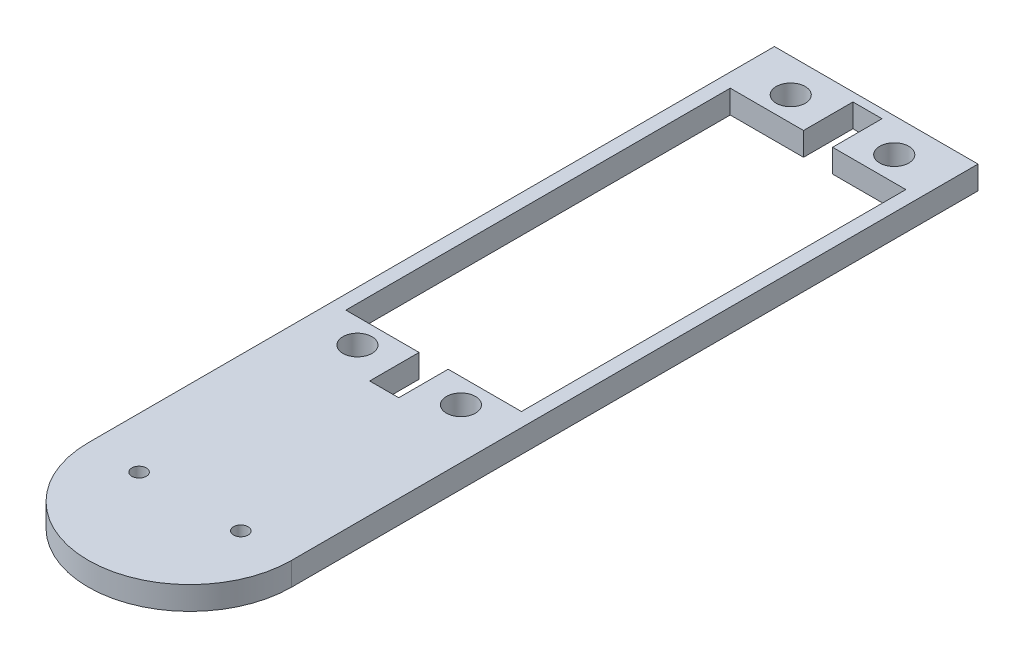
ISO-10303-21;
HEADER;
FILE_DESCRIPTION(('STEP AP214'),'2;1');
FILE_NAME('part.step','',(''),(''),'','','');
FILE_SCHEMA(('AUTOMOTIVE_DESIGN { 1 0 10303 214 1 1 1 1 }'));
ENDSEC;
DATA;
#1=APPLICATION_CONTEXT('core data for automotive mechanical design processes');
#2=APPLICATION_PROTOCOL_DEFINITION('international standard','automotive_design',2000,#1);
#3=PRODUCT_CONTEXT('',#1,'mechanical');
#4=PRODUCT('Part','Part','',(#3));
#5=PRODUCT_RELATED_PRODUCT_CATEGORY('part','',(#4));
#6=PRODUCT_DEFINITION_FORMATION('','',#4);
#7=PRODUCT_DEFINITION_CONTEXT('part definition',#1,'design');
#8=PRODUCT_DEFINITION('design','',#6,#7);
#9=PRODUCT_DEFINITION_SHAPE('','',#8);
#10=(LENGTH_UNIT() NAMED_UNIT(*) SI_UNIT(.MILLI.,.METRE.));
#11=(NAMED_UNIT(*) PLANE_ANGLE_UNIT() SI_UNIT($,.RADIAN.));
#12=(NAMED_UNIT(*) SI_UNIT($,.STERADIAN.) SOLID_ANGLE_UNIT());
#13=UNCERTAINTY_MEASURE_WITH_UNIT(LENGTH_MEASURE(1.E-05),#10,'distance_accuracy_value','');
#14=(GEOMETRIC_REPRESENTATION_CONTEXT(3) GLOBAL_UNCERTAINTY_ASSIGNED_CONTEXT((#13)) GLOBAL_UNIT_ASSIGNED_CONTEXT((#10,
#11,#12)) REPRESENTATION_CONTEXT('',''));
#15=CARTESIAN_POINT('',(0.,0.,0.));
#16=DIRECTION('',(0.,0.,1.));
#17=DIRECTION('',(1.,0.,0.));
#18=AXIS2_PLACEMENT_3D('',#15,#16,#17);
#19=CARTESIAN_POINT('',(-15.1,0.,-108.));
#20=DIRECTION('',(0.,0.,-1.));
#21=DIRECTION('',(-1.,0.,0.));
#22=AXIS2_PLACEMENT_3D('',#19,#20,#21);
#23=PLANE('',#22);
#24=DIRECTION('',(-1.,0.,0.));
#25=VECTOR('',#24,1.);
#26=CARTESIAN_POINT('',(-15.1,4.,-108.));
#27=LINE('',#26,#25);
#28=CARTESIAN_POINT('',(15.1,4.,-108.));
#29=VERTEX_POINT('',#28);
#30=CARTESIAN_POINT('',(2.49999999999999,4.,-108.));
#31=VERTEX_POINT('',#30);
#32=EDGE_CURVE('E249',#29,#31,#27,.T.);
#33=ORIENTED_EDGE('',*,*,#32,.T.);
#34=DIRECTION('',(0.,1.,0.));
#35=VECTOR('',#34,1.);
#36=CARTESIAN_POINT('',(2.49999999999999,0.,-108.));
#37=LINE('',#36,#35);
#38=CARTESIAN_POINT('',(2.49999999999999,0.,-108.));
#39=VERTEX_POINT('',#38);
#40=EDGE_CURVE('E180',#39,#31,#37,.T.);
#41=ORIENTED_EDGE('',*,*,#40,.F.);
#42=DIRECTION('',(-1.,0.,0.));
#43=VECTOR('',#42,1.);
#44=CARTESIAN_POINT('',(-15.1,0.,-108.));
#45=LINE('',#44,#43);
#46=CARTESIAN_POINT('',(15.1,0.,-108.));
#47=VERTEX_POINT('',#46);
#48=EDGE_CURVE('E172',#47,#39,#45,.T.);
#49=ORIENTED_EDGE('',*,*,#48,.F.);
#50=DIRECTION('',(0.,1.,0.));
#51=VECTOR('',#50,1.);
#52=CARTESIAN_POINT('',(15.1,0.,-108.));
#53=LINE('',#52,#51);
#54=EDGE_CURVE('E246',#47,#29,#53,.T.);
#55=ORIENTED_EDGE('',*,*,#54,.T.);
#56=EDGE_LOOP('',(#33,#41,#49,#55));
#57=FACE_BOUND('',#56,.T.);
#58=ADVANCED_FACE('F34',(#57),#23,.F.);
#59=CARTESIAN_POINT('',(-15.1,0.,-41.9));
#60=DIRECTION('',(0.,0.,1.));
#61=DIRECTION('',(1.,0.,0.));
#62=AXIS2_PLACEMENT_3D('',#59,#60,#61);
#63=PLANE('',#62);
#64=DIRECTION('',(1.,0.,0.));
#65=VECTOR('',#64,1.);
#66=CARTESIAN_POINT('',(-15.1,0.,-41.9));
#67=LINE('',#66,#65);
#68=CARTESIAN_POINT('',(2.49999999999999,0.,-41.9));
#69=VERTEX_POINT('',#68);
#70=CARTESIAN_POINT('',(15.1,0.,-41.9));
#71=VERTEX_POINT('',#70);
#72=EDGE_CURVE('E242',#69,#71,#67,.T.);
#73=ORIENTED_EDGE('',*,*,#72,.F.);
#74=DIRECTION('',(0.,1.,0.));
#75=VECTOR('',#74,1.);
#76=CARTESIAN_POINT('',(2.49999999999999,0.,-41.9));
#77=LINE('',#76,#75);
#78=CARTESIAN_POINT('',(2.49999999999999,4.,-41.9));
#79=VERTEX_POINT('',#78);
#80=EDGE_CURVE('E201',#69,#79,#77,.T.);
#81=ORIENTED_EDGE('',*,*,#80,.T.);
#82=DIRECTION('',(1.,0.,0.));
#83=VECTOR('',#82,1.);
#84=CARTESIAN_POINT('',(-15.1,4.,-41.9));
#85=LINE('',#84,#83);
#86=CARTESIAN_POINT('',(15.1,4.,-41.9));
#87=VERTEX_POINT('',#86);
#88=EDGE_CURVE('E255',#79,#87,#85,.T.);
#89=ORIENTED_EDGE('',*,*,#88,.T.);
#90=DIRECTION('',(0.,1.,0.));
#91=VECTOR('',#90,1.);
#92=CARTESIAN_POINT('',(15.1,0.,-41.9));
#93=LINE('',#92,#91);
#94=EDGE_CURVE('E258',#71,#87,#93,.T.);
#95=ORIENTED_EDGE('',*,*,#94,.F.);
#96=EDGE_LOOP('',(#73,#81,#89,#95));
#97=FACE_BOUND('',#96,.T.);
#98=ADVANCED_FACE('F330',(#97),#63,.F.);
#99=CARTESIAN_POINT('',(0.,4.,0.));
#100=DIRECTION('',(0.,-1.,0.));
#101=DIRECTION('',(0.,0.,-1.));
#102=AXIS2_PLACEMENT_3D('',#99,#100,#101);
#103=CYLINDRICAL_SURFACE('',#102,17.5);
#104=CARTESIAN_POINT('',(0.,0.,0.));
#105=DIRECTION('',(0.,1.,0.));
#106=DIRECTION('',(0.,0.,1.));
#107=AXIS2_PLACEMENT_3D('',#104,#105,#106);
#108=CIRCLE('',#107,17.5);
#109=CARTESIAN_POINT('',(-17.5,0.,0.));
#110=VERTEX_POINT('',#109);
#111=CARTESIAN_POINT('',(17.5,0.,0.));
#112=VERTEX_POINT('',#111);
#113=EDGE_CURVE('E278',#110,#112,#108,.T.);
#114=ORIENTED_EDGE('',*,*,#113,.T.);
#115=DIRECTION('',(0.,-1.,0.));
#116=VECTOR('',#115,1.);
#117=CARTESIAN_POINT('',(17.5,4.,0.));
#118=LINE('',#117,#116);
#119=CARTESIAN_POINT('',(17.5,4.,0.));
#120=VERTEX_POINT('',#119);
#121=EDGE_CURVE('E11',#120,#112,#118,.T.);
#122=ORIENTED_EDGE('',*,*,#121,.F.);
#123=CARTESIAN_POINT('',(0.,4.,0.));
#124=DIRECTION('',(0.,1.,0.));
#125=DIRECTION('',(0.,0.,1.));
#126=AXIS2_PLACEMENT_3D('',#123,#124,#125);
#127=CIRCLE('',#126,17.5);
#128=CARTESIAN_POINT('',(-17.5,4.,0.));
#129=VERTEX_POINT('',#128);
#130=EDGE_CURVE('E281',#129,#120,#127,.T.);
#131=ORIENTED_EDGE('',*,*,#130,.F.);
#132=DIRECTION('',(0.,-1.,0.));
#133=VECTOR('',#132,1.);
#134=CARTESIAN_POINT('',(-17.5,4.,0.));
#135=LINE('',#134,#133);
#136=EDGE_CURVE('E291',#129,#110,#135,.T.);
#137=ORIENTED_EDGE('',*,*,#136,.T.);
#138=EDGE_LOOP('',(#114,#122,#131,#137));
#139=FACE_BOUND('',#138,.T.);
#140=ADVANCED_FACE('F36',(#139),#103,.T.);
#141=CARTESIAN_POINT('',(17.5,4.,-118.));
#142=DIRECTION('',(-1.,0.,0.));
#143=DIRECTION('',(0.,0.,1.));
#144=AXIS2_PLACEMENT_3D('',#141,#142,#143);
#145=PLANE('',#144);
#146=DIRECTION('',(0.,0.,-1.));
#147=VECTOR('',#146,1.);
#148=CARTESIAN_POINT('',(17.5,0.,-118.));
#149=LINE('',#148,#147);
#150=CARTESIAN_POINT('',(17.5,0.,-118.));
#151=VERTEX_POINT('',#150);
#152=EDGE_CURVE('E294',#112,#151,#149,.T.);
#153=ORIENTED_EDGE('',*,*,#152,.T.);
#154=DIRECTION('',(0.,-1.,0.));
#155=VECTOR('',#154,1.);
#156=CARTESIAN_POINT('',(17.5,4.,-118.));
#157=LINE('',#156,#155);
#158=CARTESIAN_POINT('',(17.5,4.,-118.));
#159=VERTEX_POINT('',#158);
#160=EDGE_CURVE('E42',#159,#151,#157,.T.);
#161=ORIENTED_EDGE('',*,*,#160,.F.);
#162=DIRECTION('',(0.,0.,-1.));
#163=VECTOR('',#162,1.);
#164=CARTESIAN_POINT('',(17.5,4.,-118.));
#165=LINE('',#164,#163);
#166=EDGE_CURVE('E284',#120,#159,#165,.T.);
#167=ORIENTED_EDGE('',*,*,#166,.F.);
#168=ORIENTED_EDGE('',*,*,#121,.T.);
#169=EDGE_LOOP('',(#153,#161,#167,#168));
#170=FACE_BOUND('',#169,.T.);
#171=ADVANCED_FACE('F323',(#170),#145,.F.);
#172=CARTESIAN_POINT('',(-17.5,4.,-118.));
#173=DIRECTION('',(0.,0.,1.));
#174=DIRECTION('',(1.,0.,0.));
#175=AXIS2_PLACEMENT_3D('',#172,#173,#174);
#176=PLANE('',#175);
#177=DIRECTION('',(-1.,0.,0.));
#178=VECTOR('',#177,1.);
#179=CARTESIAN_POINT('',(-17.5,0.,-118.));
#180=LINE('',#179,#178);
#181=CARTESIAN_POINT('',(-17.5,0.,-118.));
#182=VERTEX_POINT('',#181);
#183=EDGE_CURVE('E296',#151,#182,#180,.T.);
#184=ORIENTED_EDGE('',*,*,#183,.T.);
#185=DIRECTION('',(0.,-1.,0.));
#186=VECTOR('',#185,1.);
#187=CARTESIAN_POINT('',(-17.5,4.,-118.));
#188=LINE('',#187,#186);
#189=CARTESIAN_POINT('',(-17.5,4.,-118.));
#190=VERTEX_POINT('',#189);
#191=EDGE_CURVE('E301',#190,#182,#188,.T.);
#192=ORIENTED_EDGE('',*,*,#191,.F.);
#193=DIRECTION('',(-1.,0.,0.));
#194=VECTOR('',#193,1.);
#195=CARTESIAN_POINT('',(-17.5,4.,-118.));
#196=LINE('',#195,#194);
#197=EDGE_CURVE('E287',#159,#190,#196,.T.);
#198=ORIENTED_EDGE('',*,*,#197,.F.);
#199=ORIENTED_EDGE('',*,*,#160,.T.);
#200=EDGE_LOOP('',(#184,#192,#198,#199));
#201=FACE_BOUND('',#200,.T.);
#202=ADVANCED_FACE('F308',(#201),#176,.F.);
#203=CARTESIAN_POINT('',(-17.5,4.,0.));
#204=DIRECTION('',(1.,0.,0.));
#205=DIRECTION('',(0.,0.,-1.));
#206=AXIS2_PLACEMENT_3D('',#203,#204,#205);
#207=PLANE('',#206);
#208=DIRECTION('',(0.,0.,1.));
#209=VECTOR('',#208,1.);
#210=CARTESIAN_POINT('',(-17.5,0.,0.));
#211=LINE('',#210,#209);
#212=EDGE_CURVE('E285',#182,#110,#211,.T.);
#213=ORIENTED_EDGE('',*,*,#212,.T.);
#214=ORIENTED_EDGE('',*,*,#136,.F.);
#215=DIRECTION('',(0.,0.,1.));
#216=VECTOR('',#215,1.);
#217=CARTESIAN_POINT('',(-17.5,4.,0.));
#218=LINE('',#217,#216);
#219=EDGE_CURVE('E289',#190,#129,#218,.T.);
#220=ORIENTED_EDGE('',*,*,#219,.F.);
#221=ORIENTED_EDGE('',*,*,#191,.T.);
#222=EDGE_LOOP('',(#213,#214,#220,#221));
#223=FACE_BOUND('',#222,.T.);
#224=ADVANCED_FACE('F316',(#223),#207,.F.);
#225=CARTESIAN_POINT('',(0.,4.,0.));
#226=DIRECTION('',(0.,1.,0.));
#227=DIRECTION('',(0.,0.,1.));
#228=AXIS2_PLACEMENT_3D('',#225,#226,#227);
#229=PLANE('',#228);
#230=DIRECTION('',(0.,0.,-1.));
#231=VECTOR('',#230,1.);
#232=CARTESIAN_POINT('',(2.49999999999999,4.,-116.5));
#233=LINE('',#232,#231);
#234=CARTESIAN_POINT('',(2.49999999999999,4.,-116.5));
#235=VERTEX_POINT('',#234);
#236=EDGE_CURVE('E153',#31,#235,#233,.T.);
#237=ORIENTED_EDGE('',*,*,#236,.F.);
#238=ORIENTED_EDGE('',*,*,#32,.F.);
#239=DIRECTION('',(0.,0.,-1.));
#240=VECTOR('',#239,1.);
#241=CARTESIAN_POINT('',(15.1,4.,-108.));
#242=LINE('',#241,#240);
#243=EDGE_CURVE('E231',#87,#29,#242,.T.);
#244=ORIENTED_EDGE('',*,*,#243,.F.);
#245=ORIENTED_EDGE('',*,*,#88,.F.);
#246=DIRECTION('',(0.,0.,-1.));
#247=VECTOR('',#246,1.);
#248=CARTESIAN_POINT('',(2.49999999999999,4.,-33.4));
#249=LINE('',#248,#247);
#250=CARTESIAN_POINT('',(2.49999999999999,4.,-33.4));
#251=VERTEX_POINT('',#250);
#252=EDGE_CURVE('E188',#251,#79,#249,.T.);
#253=ORIENTED_EDGE('',*,*,#252,.F.);
#254=DIRECTION('',(1.,0.,0.));
#255=VECTOR('',#254,1.);
#256=CARTESIAN_POINT('',(-2.50000000000001,4.,-33.4));
#257=LINE('',#256,#255);
#258=CARTESIAN_POINT('',(-2.50000000000001,4.,-33.4));
#259=VERTEX_POINT('',#258);
#260=EDGE_CURVE('E197',#259,#251,#257,.T.);
#261=ORIENTED_EDGE('',*,*,#260,.F.);
#262=DIRECTION('',(0.,0.,1.));
#263=VECTOR('',#262,1.);
#264=CARTESIAN_POINT('',(-2.50000000000001,4.,-41.9));
#265=LINE('',#264,#263);
#266=CARTESIAN_POINT('',(-2.50000000000001,4.,-41.9));
#267=VERTEX_POINT('',#266);
#268=EDGE_CURVE('E182',#267,#259,#265,.T.);
#269=ORIENTED_EDGE('',*,*,#268,.F.);
#270=CARTESIAN_POINT('',(-15.1,4.,-41.9));
#271=VERTEX_POINT('',#270);
#272=EDGE_CURVE('E237',#271,#267,#85,.T.);
#273=ORIENTED_EDGE('',*,*,#272,.F.);
#274=DIRECTION('',(0.,0.,1.));
#275=VECTOR('',#274,1.);
#276=CARTESIAN_POINT('',(-15.1,4.,-108.));
#277=LINE('',#276,#275);
#278=CARTESIAN_POINT('',(-15.1,4.,-108.));
#279=VERTEX_POINT('',#278);
#280=EDGE_CURVE('E252',#279,#271,#277,.T.);
#281=ORIENTED_EDGE('',*,*,#280,.F.);
#282=CARTESIAN_POINT('',(-2.50000000000001,4.,-108.));
#283=VERTEX_POINT('',#282);
#284=EDGE_CURVE('E248',#283,#279,#27,.T.);
#285=ORIENTED_EDGE('',*,*,#284,.F.);
#286=DIRECTION('',(0.,0.,1.));
#287=VECTOR('',#286,1.);
#288=CARTESIAN_POINT('',(-2.50000000000001,4.,-108.));
#289=LINE('',#288,#287);
#290=CARTESIAN_POINT('',(-2.50000000000001,4.,-116.5));
#291=VERTEX_POINT('',#290);
#292=EDGE_CURVE('E49',#291,#283,#289,.T.);
#293=ORIENTED_EDGE('',*,*,#292,.F.);
#294=DIRECTION('',(-1.,0.,0.));
#295=VECTOR('',#294,1.);
#296=CARTESIAN_POINT('',(-2.50000000000001,4.,-116.5));
#297=LINE('',#296,#295);
#298=EDGE_CURVE('E174',#235,#291,#297,.T.);
#299=ORIENTED_EDGE('',*,*,#298,.F.);
#300=EDGE_LOOP('',(#237,#238,#244,#245,#253,#261,#269,#273,#281,#285,#293,#299));
#301=FACE_BOUND('',#300,.T.);
#302=CARTESIAN_POINT('',(-8.90000000000002,4.,-112.2));
#303=DIRECTION('',(0.,1.,0.));
#304=DIRECTION('',(0.,0.,-1.));
#305=AXIS2_PLACEMENT_3D('',#302,#303,#304);
#306=CIRCLE('',#305,2.5);
#307=CARTESIAN_POINT('',(-8.90000000000002,4.,-114.7));
#308=VERTEX_POINT('',#307);
#309=EDGE_CURVE('E204',#308,#308,#306,.T.);
#310=ORIENTED_EDGE('',*,*,#309,.F.);
#311=EDGE_LOOP('',(#310));
#312=FACE_BOUND('',#311,.T.);
#313=CARTESIAN_POINT('',(8.90000000000001,4.,-112.2));
#314=DIRECTION('',(0.,1.,0.));
#315=DIRECTION('',(0.,0.,1.));
#316=AXIS2_PLACEMENT_3D('',#313,#314,#315);
#317=CIRCLE('',#316,2.5);
#318=CARTESIAN_POINT('',(8.90000000000001,4.,-109.7));
#319=VERTEX_POINT('',#318);
#320=EDGE_CURVE('E213',#319,#319,#317,.T.);
#321=ORIENTED_EDGE('',*,*,#320,.F.);
#322=EDGE_LOOP('',(#321));
#323=FACE_BOUND('',#322,.T.);
#324=CARTESIAN_POINT('',(-8.90000000000001,4.,-37.7));
#325=DIRECTION('',(0.,1.,0.));
#326=DIRECTION('',(0.,0.,1.));
#327=AXIS2_PLACEMENT_3D('',#324,#325,#326);
#328=CIRCLE('',#327,2.5);
#329=CARTESIAN_POINT('',(-8.90000000000001,4.,-35.2));
#330=VERTEX_POINT('',#329);
#331=EDGE_CURVE('E219',#330,#330,#328,.T.);
#332=ORIENTED_EDGE('',*,*,#331,.F.);
#333=EDGE_LOOP('',(#332));
#334=FACE_BOUND('',#333,.T.);
#335=CARTESIAN_POINT('',(8.90000000000001,4.,-37.7));
#336=DIRECTION('',(0.,1.,0.));
#337=DIRECTION('',(0.,0.,-1.));
#338=AXIS2_PLACEMENT_3D('',#335,#336,#337);
#339=CIRCLE('',#338,2.5);
#340=CARTESIAN_POINT('',(8.90000000000001,4.,-40.2));
#341=VERTEX_POINT('',#340);
#342=EDGE_CURVE('E225',#341,#341,#339,.T.);
#343=ORIENTED_EDGE('',*,*,#342,.F.);
#344=EDGE_LOOP('',(#343));
#345=FACE_BOUND('',#344,.T.);
#346=CARTESIAN_POINT('',(8.75,4.,0.));
#347=DIRECTION('',(0.,1.,0.));
#348=DIRECTION('',(0.,0.,1.));
#349=AXIS2_PLACEMENT_3D('',#346,#347,#348);
#350=CIRCLE('',#349,1.25);
#351=CARTESIAN_POINT('',(8.75,4.,1.25));
#352=VERTEX_POINT('',#351);
#353=EDGE_CURVE('E261',#352,#352,#350,.T.);
#354=ORIENTED_EDGE('',*,*,#353,.F.);
#355=EDGE_LOOP('',(#354));
#356=FACE_BOUND('',#355,.T.);
#357=CARTESIAN_POINT('',(-8.75,4.,0.));
#358=DIRECTION('',(0.,1.,0.));
#359=DIRECTION('',(0.,0.,1.));
#360=AXIS2_PLACEMENT_3D('',#357,#358,#359);
#361=CIRCLE('',#360,1.25);
#362=CARTESIAN_POINT('',(-8.75,4.,1.25));
#363=VERTEX_POINT('',#362);
#364=EDGE_CURVE('E272',#363,#363,#361,.T.);
#365=ORIENTED_EDGE('',*,*,#364,.F.);
#366=EDGE_LOOP('',(#365));
#367=FACE_BOUND('',#366,.T.);
#368=ORIENTED_EDGE('',*,*,#130,.T.);
#369=ORIENTED_EDGE('',*,*,#166,.T.);
#370=ORIENTED_EDGE('',*,*,#197,.T.);
#371=ORIENTED_EDGE('',*,*,#219,.T.);
#372=EDGE_LOOP('',(#368,#369,#370,#371));
#373=FACE_BOUND('',#372,.T.);
#374=ADVANCED_FACE('F322',(#301,#312,#323,#334,#345,#356,#367,#373),#229,.T.);
#375=CARTESIAN_POINT('',(0.,0.,0.));
#376=DIRECTION('',(0.,1.,0.));
#377=DIRECTION('',(0.,0.,1.));
#378=AXIS2_PLACEMENT_3D('',#375,#376,#377);
#379=PLANE('',#378);
#380=ORIENTED_EDGE('',*,*,#48,.T.);
#381=DIRECTION('',(0.,0.,-1.));
#382=VECTOR('',#381,1.);
#383=CARTESIAN_POINT('',(2.49999999999999,0.,-116.5));
#384=LINE('',#383,#382);
#385=CARTESIAN_POINT('',(2.49999999999999,0.,-116.5));
#386=VERTEX_POINT('',#385);
#387=EDGE_CURVE('E150',#39,#386,#384,.T.);
#388=ORIENTED_EDGE('',*,*,#387,.T.);
#389=DIRECTION('',(-1.,0.,0.));
#390=VECTOR('',#389,1.);
#391=CARTESIAN_POINT('',(-2.50000000000001,0.,-116.5));
#392=LINE('',#391,#390);
#393=CARTESIAN_POINT('',(-2.50000000000001,0.,-116.5));
#394=VERTEX_POINT('',#393);
#395=EDGE_CURVE('E161',#386,#394,#392,.T.);
#396=ORIENTED_EDGE('',*,*,#395,.T.);
#397=DIRECTION('',(0.,0.,1.));
#398=VECTOR('',#397,1.);
#399=CARTESIAN_POINT('',(-2.50000000000001,0.,-108.));
#400=LINE('',#399,#398);
#401=CARTESIAN_POINT('',(-2.50000000000001,0.,-108.));
#402=VERTEX_POINT('',#401);
#403=EDGE_CURVE('E158',#394,#402,#400,.T.);
#404=ORIENTED_EDGE('',*,*,#403,.T.);
#405=CARTESIAN_POINT('',(-15.1,0.,-108.));
#406=VERTEX_POINT('',#405);
#407=EDGE_CURVE('E236',#402,#406,#45,.T.);
#408=ORIENTED_EDGE('',*,*,#407,.T.);
#409=DIRECTION('',(0.,0.,1.));
#410=VECTOR('',#409,1.);
#411=CARTESIAN_POINT('',(-15.1,0.,-108.));
#412=LINE('',#411,#410);
#413=CARTESIAN_POINT('',(-15.1,0.,-41.9));
#414=VERTEX_POINT('',#413);
#415=EDGE_CURVE('E239',#406,#414,#412,.T.);
#416=ORIENTED_EDGE('',*,*,#415,.T.);
#417=CARTESIAN_POINT('',(-2.50000000000001,0.,-41.9));
#418=VERTEX_POINT('',#417);
#419=EDGE_CURVE('E243',#414,#418,#67,.T.);
#420=ORIENTED_EDGE('',*,*,#419,.T.);
#421=DIRECTION('',(0.,0.,1.));
#422=VECTOR('',#421,1.);
#423=CARTESIAN_POINT('',(-2.50000000000001,0.,-41.9));
#424=LINE('',#423,#422);
#425=CARTESIAN_POINT('',(-2.50000000000001,0.,-33.4));
#426=VERTEX_POINT('',#425);
#427=EDGE_CURVE('E57',#418,#426,#424,.T.);
#428=ORIENTED_EDGE('',*,*,#427,.T.);
#429=DIRECTION('',(1.,0.,0.));
#430=VECTOR('',#429,1.);
#431=CARTESIAN_POINT('',(-2.50000000000001,0.,-33.4));
#432=LINE('',#431,#430);
#433=CARTESIAN_POINT('',(2.49999999999999,0.,-33.4));
#434=VERTEX_POINT('',#433);
#435=EDGE_CURVE('E187',#426,#434,#432,.T.);
#436=ORIENTED_EDGE('',*,*,#435,.T.);
#437=DIRECTION('',(0.,0.,-1.));
#438=VECTOR('',#437,1.);
#439=CARTESIAN_POINT('',(2.49999999999999,0.,-33.4));
#440=LINE('',#439,#438);
#441=EDGE_CURVE('E191',#434,#69,#440,.T.);
#442=ORIENTED_EDGE('',*,*,#441,.T.);
#443=ORIENTED_EDGE('',*,*,#72,.T.);
#444=DIRECTION('',(0.,0.,-1.));
#445=VECTOR('',#444,1.);
#446=CARTESIAN_POINT('',(15.1,0.,-108.));
#447=LINE('',#446,#445);
#448=EDGE_CURVE('E234',#71,#47,#447,.T.);
#449=ORIENTED_EDGE('',*,*,#448,.T.);
#450=EDGE_LOOP('',(#380,#388,#396,#404,#408,#416,#420,#428,#436,#442,#443,#449));
#451=FACE_BOUND('',#450,.T.);
#452=CARTESIAN_POINT('',(-8.90000000000002,0.,-112.2));
#453=DIRECTION('',(0.,1.,0.));
#454=DIRECTION('',(0.,0.,-1.));
#455=AXIS2_PLACEMENT_3D('',#452,#453,#454);
#456=CIRCLE('',#455,2.5);
#457=CARTESIAN_POINT('',(-8.90000000000002,0.,-114.7));
#458=VERTEX_POINT('',#457);
#459=EDGE_CURVE('E210',#458,#458,#456,.T.);
#460=ORIENTED_EDGE('',*,*,#459,.T.);
#461=EDGE_LOOP('',(#460));
#462=FACE_BOUND('',#461,.T.);
#463=CARTESIAN_POINT('',(8.90000000000001,0.,-112.2));
#464=DIRECTION('',(0.,1.,0.));
#465=DIRECTION('',(0.,0.,1.));
#466=AXIS2_PLACEMENT_3D('',#463,#464,#465);
#467=CIRCLE('',#466,2.5);
#468=CARTESIAN_POINT('',(8.90000000000001,0.,-109.7));
#469=VERTEX_POINT('',#468);
#470=EDGE_CURVE('E216',#469,#469,#467,.T.);
#471=ORIENTED_EDGE('',*,*,#470,.T.);
#472=EDGE_LOOP('',(#471));
#473=FACE_BOUND('',#472,.T.);
#474=CARTESIAN_POINT('',(-8.90000000000001,0.,-37.7));
#475=DIRECTION('',(0.,1.,0.));
#476=DIRECTION('',(0.,0.,1.));
#477=AXIS2_PLACEMENT_3D('',#474,#475,#476);
#478=CIRCLE('',#477,2.5);
#479=CARTESIAN_POINT('',(-8.90000000000001,0.,-35.2));
#480=VERTEX_POINT('',#479);
#481=EDGE_CURVE('E222',#480,#480,#478,.T.);
#482=ORIENTED_EDGE('',*,*,#481,.T.);
#483=EDGE_LOOP('',(#482));
#484=FACE_BOUND('',#483,.T.);
#485=CARTESIAN_POINT('',(8.90000000000001,0.,-37.7));
#486=DIRECTION('',(0.,1.,0.));
#487=DIRECTION('',(0.,0.,-1.));
#488=AXIS2_PLACEMENT_3D('',#485,#486,#487);
#489=CIRCLE('',#488,2.5);
#490=CARTESIAN_POINT('',(8.90000000000001,0.,-40.2));
#491=VERTEX_POINT('',#490);
#492=EDGE_CURVE('E228',#491,#491,#489,.T.);
#493=ORIENTED_EDGE('',*,*,#492,.T.);
#494=EDGE_LOOP('',(#493));
#495=FACE_BOUND('',#494,.T.);
#496=CARTESIAN_POINT('',(8.75,0.,0.));
#497=DIRECTION('',(0.,1.,0.));
#498=DIRECTION('',(0.,0.,1.));
#499=AXIS2_PLACEMENT_3D('',#496,#497,#498);
#500=CIRCLE('',#499,1.25);
#501=CARTESIAN_POINT('',(8.75,0.,1.25));
#502=VERTEX_POINT('',#501);
#503=EDGE_CURVE('E269',#502,#502,#500,.T.);
#504=ORIENTED_EDGE('',*,*,#503,.T.);
#505=EDGE_LOOP('',(#504));
#506=FACE_BOUND('',#505,.T.);
#507=CARTESIAN_POINT('',(-8.75,0.,0.));
#508=DIRECTION('',(0.,1.,0.));
#509=DIRECTION('',(0.,0.,1.));
#510=AXIS2_PLACEMENT_3D('',#507,#508,#509);
#511=CIRCLE('',#510,1.25);
#512=CARTESIAN_POINT('',(-8.75,0.,1.25));
#513=VERTEX_POINT('',#512);
#514=EDGE_CURVE('E275',#513,#513,#511,.T.);
#515=ORIENTED_EDGE('',*,*,#514,.T.);
#516=EDGE_LOOP('',(#515));
#517=FACE_BOUND('',#516,.T.);
#518=ORIENTED_EDGE('',*,*,#113,.F.);
#519=ORIENTED_EDGE('',*,*,#212,.F.);
#520=ORIENTED_EDGE('',*,*,#183,.F.);
#521=ORIENTED_EDGE('',*,*,#152,.F.);
#522=EDGE_LOOP('',(#518,#519,#520,#521));
#523=FACE_BOUND('',#522,.T.);
#524=ADVANCED_FACE('F168',(#451,#462,#473,#484,#495,#506,#517,#523),#379,.F.);
#525=CARTESIAN_POINT('',(-8.75,0.,0.));
#526=DIRECTION('',(0.,1.,0.));
#527=DIRECTION('',(0.,0.,1.));
#528=AXIS2_PLACEMENT_3D('',#525,#526,#527);
#529=CYLINDRICAL_SURFACE('',#528,1.25);
#530=ORIENTED_EDGE('',*,*,#514,.F.);
#531=EDGE_LOOP('',(#530));
#532=FACE_BOUND('',#531,.T.);
#533=ORIENTED_EDGE('',*,*,#364,.T.);
#534=EDGE_LOOP('',(#533));
#535=FACE_BOUND('',#534,.T.);
#536=ADVANCED_FACE('F412',(#532,#535),#529,.F.);
#537=CARTESIAN_POINT('',(8.75,0.,0.));
#538=DIRECTION('',(0.,1.,0.));
#539=DIRECTION('',(0.,0.,1.));
#540=AXIS2_PLACEMENT_3D('',#537,#538,#539);
#541=CYLINDRICAL_SURFACE('',#540,1.25);
#542=ORIENTED_EDGE('',*,*,#503,.F.);
#543=EDGE_LOOP('',(#542));
#544=FACE_BOUND('',#543,.T.);
#545=ORIENTED_EDGE('',*,*,#353,.T.);
#546=EDGE_LOOP('',(#545));
#547=FACE_BOUND('',#546,.T.);
#548=ADVANCED_FACE('F408',(#544,#547),#541,.F.);
#549=CARTESIAN_POINT('',(15.1,0.,-108.));
#550=DIRECTION('',(1.,0.,0.));
#551=DIRECTION('',(0.,0.,-1.));
#552=AXIS2_PLACEMENT_3D('',#549,#550,#551);
#553=PLANE('',#552);
#554=ORIENTED_EDGE('',*,*,#243,.T.);
#555=ORIENTED_EDGE('',*,*,#54,.F.);
#556=ORIENTED_EDGE('',*,*,#448,.F.);
#557=ORIENTED_EDGE('',*,*,#94,.T.);
#558=EDGE_LOOP('',(#554,#555,#556,#557));
#559=FACE_BOUND('',#558,.T.);
#560=ADVANCED_FACE('F379',(#559),#553,.F.);
#561=ORIENTED_EDGE('',*,*,#272,.T.);
#562=DIRECTION('',(0.,1.,0.));
#563=VECTOR('',#562,1.);
#564=CARTESIAN_POINT('',(-2.50000000000001,0.,-41.9));
#565=LINE('',#564,#563);
#566=EDGE_CURVE('E194',#418,#267,#565,.T.);
#567=ORIENTED_EDGE('',*,*,#566,.F.);
#568=ORIENTED_EDGE('',*,*,#419,.F.);
#569=DIRECTION('',(0.,1.,0.));
#570=VECTOR('',#569,1.);
#571=CARTESIAN_POINT('',(-15.1,0.,-41.9));
#572=LINE('',#571,#570);
#573=EDGE_CURVE('E262',#414,#271,#572,.T.);
#574=ORIENTED_EDGE('',*,*,#573,.T.);
#575=EDGE_LOOP('',(#561,#567,#568,#574));
#576=FACE_BOUND('',#575,.T.);
#577=ADVANCED_FACE('F340',(#576),#63,.F.);
#578=CARTESIAN_POINT('',(-15.1,0.,-108.));
#579=DIRECTION('',(-1.,0.,0.));
#580=DIRECTION('',(0.,0.,1.));
#581=AXIS2_PLACEMENT_3D('',#578,#579,#580);
#582=PLANE('',#581);
#583=ORIENTED_EDGE('',*,*,#280,.T.);
#584=ORIENTED_EDGE('',*,*,#573,.F.);
#585=ORIENTED_EDGE('',*,*,#415,.F.);
#586=DIRECTION('',(0.,1.,0.));
#587=VECTOR('',#586,1.);
#588=CARTESIAN_POINT('',(-15.1,0.,-108.));
#589=LINE('',#588,#587);
#590=EDGE_CURVE('E264',#406,#279,#589,.T.);
#591=ORIENTED_EDGE('',*,*,#590,.T.);
#592=EDGE_LOOP('',(#583,#584,#585,#591));
#593=FACE_BOUND('',#592,.T.);
#594=ADVANCED_FACE('F345',(#593),#582,.F.);
#595=ORIENTED_EDGE('',*,*,#407,.F.);
#596=DIRECTION('',(0.,1.,0.));
#597=VECTOR('',#596,1.);
#598=CARTESIAN_POINT('',(-2.50000000000001,0.,-108.));
#599=LINE('',#598,#597);
#600=EDGE_CURVE('E183',#402,#283,#599,.T.);
#601=ORIENTED_EDGE('',*,*,#600,.T.);
#602=ORIENTED_EDGE('',*,*,#284,.T.);
#603=ORIENTED_EDGE('',*,*,#590,.F.);
#604=EDGE_LOOP('',(#595,#601,#602,#603));
#605=FACE_BOUND('',#604,.T.);
#606=ADVANCED_FACE('F334',(#605),#23,.F.);
#607=CARTESIAN_POINT('',(8.90000000000001,0.,-37.7));
#608=DIRECTION('',(0.,1.,0.));
#609=DIRECTION('',(0.,0.,1.));
#610=AXIS2_PLACEMENT_3D('',#607,#608,#609);
#611=CYLINDRICAL_SURFACE('',#610,2.5);
#612=ORIENTED_EDGE('',*,*,#492,.F.);
#613=EDGE_LOOP('',(#612));
#614=FACE_BOUND('',#613,.T.);
#615=ORIENTED_EDGE('',*,*,#342,.T.);
#616=EDGE_LOOP('',(#615));
#617=FACE_BOUND('',#616,.T.);
#618=ADVANCED_FACE('F344',(#614,#617),#611,.F.);
#619=CARTESIAN_POINT('',(-8.90000000000001,0.,-37.7));
#620=DIRECTION('',(0.,1.,0.));
#621=DIRECTION('',(0.,0.,1.));
#622=AXIS2_PLACEMENT_3D('',#619,#620,#621);
#623=CYLINDRICAL_SURFACE('',#622,2.5);
#624=ORIENTED_EDGE('',*,*,#481,.F.);
#625=EDGE_LOOP('',(#624));
#626=FACE_BOUND('',#625,.T.);
#627=ORIENTED_EDGE('',*,*,#331,.T.);
#628=EDGE_LOOP('',(#627));
#629=FACE_BOUND('',#628,.T.);
#630=ADVANCED_FACE('F351',(#626,#629),#623,.F.);
#631=CARTESIAN_POINT('',(8.90000000000001,0.,-112.2));
#632=DIRECTION('',(0.,1.,0.));
#633=DIRECTION('',(0.,0.,1.));
#634=AXIS2_PLACEMENT_3D('',#631,#632,#633);
#635=CYLINDRICAL_SURFACE('',#634,2.5);
#636=ORIENTED_EDGE('',*,*,#470,.F.);
#637=EDGE_LOOP('',(#636));
#638=FACE_BOUND('',#637,.T.);
#639=ORIENTED_EDGE('',*,*,#320,.T.);
#640=EDGE_LOOP('',(#639));
#641=FACE_BOUND('',#640,.T.);
#642=ADVANCED_FACE('F397',(#638,#641),#635,.F.);
#643=CARTESIAN_POINT('',(-8.90000000000002,0.,-112.2));
#644=DIRECTION('',(0.,1.,0.));
#645=DIRECTION('',(0.,0.,1.));
#646=AXIS2_PLACEMENT_3D('',#643,#644,#645);
#647=CYLINDRICAL_SURFACE('',#646,2.5);
#648=ORIENTED_EDGE('',*,*,#459,.F.);
#649=EDGE_LOOP('',(#648));
#650=FACE_BOUND('',#649,.T.);
#651=ORIENTED_EDGE('',*,*,#309,.T.);
#652=EDGE_LOOP('',(#651));
#653=FACE_BOUND('',#652,.T.);
#654=ADVANCED_FACE('F394',(#650,#653),#647,.F.);
#655=CARTESIAN_POINT('',(2.49999999999999,0.,-33.4));
#656=DIRECTION('',(1.,0.,0.));
#657=DIRECTION('',(0.,0.,-1.));
#658=AXIS2_PLACEMENT_3D('',#655,#656,#657);
#659=PLANE('',#658);
#660=ORIENTED_EDGE('',*,*,#252,.T.);
#661=ORIENTED_EDGE('',*,*,#80,.F.);
#662=ORIENTED_EDGE('',*,*,#441,.F.);
#663=DIRECTION('',(0.,1.,0.));
#664=VECTOR('',#663,1.);
#665=CARTESIAN_POINT('',(2.49999999999999,0.,-33.4));
#666=LINE('',#665,#664);
#667=EDGE_CURVE('E205',#434,#251,#666,.T.);
#668=ORIENTED_EDGE('',*,*,#667,.T.);
#669=EDGE_LOOP('',(#660,#661,#662,#668));
#670=FACE_BOUND('',#669,.T.);
#671=ADVANCED_FACE('F371',(#670),#659,.F.);
#672=CARTESIAN_POINT('',(-2.50000000000001,0.,-33.4));
#673=DIRECTION('',(0.,0.,1.));
#674=DIRECTION('',(1.,0.,0.));
#675=AXIS2_PLACEMENT_3D('',#672,#673,#674);
#676=PLANE('',#675);
#677=ORIENTED_EDGE('',*,*,#260,.T.);
#678=ORIENTED_EDGE('',*,*,#667,.F.);
#679=ORIENTED_EDGE('',*,*,#435,.F.);
#680=DIRECTION('',(0.,1.,0.));
#681=VECTOR('',#680,1.);
#682=CARTESIAN_POINT('',(-2.50000000000001,0.,-33.4));
#683=LINE('',#682,#681);
#684=EDGE_CURVE('E207',#426,#259,#683,.T.);
#685=ORIENTED_EDGE('',*,*,#684,.T.);
#686=EDGE_LOOP('',(#677,#678,#679,#685));
#687=FACE_BOUND('',#686,.T.);
#688=ADVANCED_FACE('F367',(#687),#676,.F.);
#689=CARTESIAN_POINT('',(-2.50000000000001,0.,-41.9));
#690=DIRECTION('',(-1.,0.,0.));
#691=DIRECTION('',(0.,0.,1.));
#692=AXIS2_PLACEMENT_3D('',#689,#690,#691);
#693=PLANE('',#692);
#694=ORIENTED_EDGE('',*,*,#268,.T.);
#695=ORIENTED_EDGE('',*,*,#684,.F.);
#696=ORIENTED_EDGE('',*,*,#427,.F.);
#697=ORIENTED_EDGE('',*,*,#566,.T.);
#698=EDGE_LOOP('',(#694,#695,#696,#697));
#699=FACE_BOUND('',#698,.T.);
#700=ADVANCED_FACE('F382',(#699),#693,.F.);
#701=CARTESIAN_POINT('',(2.49999999999999,0.,-116.5));
#702=DIRECTION('',(1.,0.,0.));
#703=DIRECTION('',(0.,0.,-1.));
#704=AXIS2_PLACEMENT_3D('',#701,#702,#703);
#705=PLANE('',#704);
#706=ORIENTED_EDGE('',*,*,#236,.T.);
#707=DIRECTION('',(0.,1.,0.));
#708=VECTOR('',#707,1.);
#709=CARTESIAN_POINT('',(2.49999999999999,0.,-116.5));
#710=LINE('',#709,#708);
#711=EDGE_CURVE('E146',#386,#235,#710,.T.);
#712=ORIENTED_EDGE('',*,*,#711,.F.);
#713=ORIENTED_EDGE('',*,*,#387,.F.);
#714=ORIENTED_EDGE('',*,*,#40,.T.);
#715=EDGE_LOOP('',(#706,#712,#713,#714));
#716=FACE_BOUND('',#715,.T.);
#717=ADVANCED_FACE('F148',(#716),#705,.F.);
#718=CARTESIAN_POINT('',(-2.50000000000001,0.,-108.));
#719=DIRECTION('',(-1.,0.,0.));
#720=DIRECTION('',(0.,0.,1.));
#721=AXIS2_PLACEMENT_3D('',#718,#719,#720);
#722=PLANE('',#721);
#723=ORIENTED_EDGE('',*,*,#292,.T.);
#724=ORIENTED_EDGE('',*,*,#600,.F.);
#725=ORIENTED_EDGE('',*,*,#403,.F.);
#726=DIRECTION('',(0.,1.,0.));
#727=VECTOR('',#726,1.);
#728=CARTESIAN_POINT('',(-2.50000000000001,0.,-116.5));
#729=LINE('',#728,#727);
#730=EDGE_CURVE('E157',#394,#291,#729,.T.);
#731=ORIENTED_EDGE('',*,*,#730,.T.);
#732=EDGE_LOOP('',(#723,#724,#725,#731));
#733=FACE_BOUND('',#732,.T.);
#734=ADVANCED_FACE('F389',(#733),#722,.F.);
#735=CARTESIAN_POINT('',(-2.50000000000001,0.,-116.5));
#736=DIRECTION('',(0.,0.,-1.));
#737=DIRECTION('',(-1.,0.,0.));
#738=AXIS2_PLACEMENT_3D('',#735,#736,#737);
#739=PLANE('',#738);
#740=ORIENTED_EDGE('',*,*,#298,.T.);
#741=ORIENTED_EDGE('',*,*,#730,.F.);
#742=ORIENTED_EDGE('',*,*,#395,.F.);
#743=ORIENTED_EDGE('',*,*,#711,.T.);
#744=EDGE_LOOP('',(#740,#741,#742,#743));
#745=FACE_BOUND('',#744,.T.);
#746=ADVANCED_FACE('F162',(#745),#739,.F.);
#747=CLOSED_SHELL('',(#58,#98,#140,#171,#202,#224,#374,#524,#536,#548,#560,#577,#594,#606,#618,
#630,#642,#654,#671,#688,#700,#717,#734,#746));
#748=MANIFOLD_SOLID_BREP('B2',#747);
#749=ADVANCED_BREP_SHAPE_REPRESENTATION('',(#18,#748),#14);
#750=SHAPE_DEFINITION_REPRESENTATION(#9,#749);
ENDSEC;
END-ISO-10303-21;
